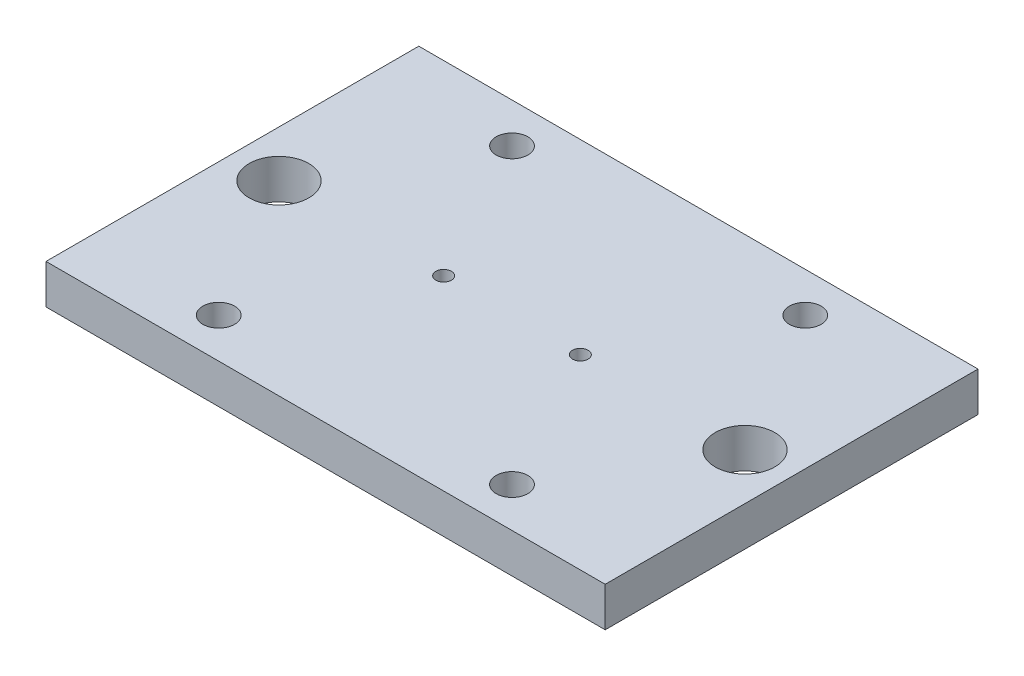
ISO-10303-21;
HEADER;
FILE_DESCRIPTION(('STEP AP214'),'2;1');
FILE_NAME('part.step','',(''),(''),'','','');
FILE_SCHEMA(('AUTOMOTIVE_DESIGN { 1 0 10303 214 1 1 1 1 }'));
ENDSEC;
DATA;
#1=APPLICATION_CONTEXT('core data for automotive mechanical design processes');
#2=APPLICATION_PROTOCOL_DEFINITION('international standard','automotive_design',2000,#1);
#3=PRODUCT_CONTEXT('',#1,'mechanical');
#4=PRODUCT('Part','Part','',(#3));
#5=PRODUCT_RELATED_PRODUCT_CATEGORY('part','',(#4));
#6=PRODUCT_DEFINITION_FORMATION('','',#4);
#7=PRODUCT_DEFINITION_CONTEXT('part definition',#1,'design');
#8=PRODUCT_DEFINITION('design','',#6,#7);
#9=PRODUCT_DEFINITION_SHAPE('','',#8);
#10=(LENGTH_UNIT() NAMED_UNIT(*) SI_UNIT(.MILLI.,.METRE.));
#11=(NAMED_UNIT(*) PLANE_ANGLE_UNIT() SI_UNIT($,.RADIAN.));
#12=(NAMED_UNIT(*) SI_UNIT($,.STERADIAN.) SOLID_ANGLE_UNIT());
#13=UNCERTAINTY_MEASURE_WITH_UNIT(LENGTH_MEASURE(1.E-05),#10,'distance_accuracy_value','');
#14=(GEOMETRIC_REPRESENTATION_CONTEXT(3) GLOBAL_UNCERTAINTY_ASSIGNED_CONTEXT((#13)) GLOBAL_UNIT_ASSIGNED_CONTEXT((#10,
#11,#12)) REPRESENTATION_CONTEXT('',''));
#15=CARTESIAN_POINT('',(0.,0.,0.));
#16=DIRECTION('',(0.,0.,1.));
#17=DIRECTION('',(1.,0.,0.));
#18=AXIS2_PLACEMENT_3D('',#15,#16,#17);
#19=CARTESIAN_POINT('',(0.,6.35,0.));
#20=DIRECTION('',(0.,-1.,0.));
#21=DIRECTION('',(0.,0.,-1.));
#22=AXIS2_PLACEMENT_3D('',#19,#20,#21);
#23=PLANE('',#22);
#24=CARTESIAN_POINT('',(-11.,6.35,0.));
#25=DIRECTION('',(0.,1.,0.));
#26=DIRECTION('',(0.,0.,1.));
#27=AXIS2_PLACEMENT_3D('',#24,#25,#26);
#28=CIRCLE('',#27,1.25);
#29=CARTESIAN_POINT('',(-11.,6.35,1.25));
#30=VERTEX_POINT('',#29);
#31=EDGE_CURVE('E120',#30,#30,#28,.T.);
#32=ORIENTED_EDGE('',*,*,#31,.F.);
#33=EDGE_LOOP('',(#32));
#34=FACE_BOUND('',#33,.T.);
#35=CARTESIAN_POINT('',(11.,6.35,0.));
#36=DIRECTION('',(0.,1.,0.));
#37=DIRECTION('',(0.,0.,1.));
#38=AXIS2_PLACEMENT_3D('',#35,#36,#37);
#39=CIRCLE('',#38,1.25);
#40=CARTESIAN_POINT('',(11.,6.35,1.25));
#41=VERTEX_POINT('',#40);
#42=EDGE_CURVE('E126',#41,#41,#39,.T.);
#43=ORIENTED_EDGE('',*,*,#42,.F.);
#44=EDGE_LOOP('',(#43));
#45=FACE_BOUND('',#44,.T.);
#46=DIRECTION('',(0.,0.,1.));
#47=VECTOR('',#46,1.);
#48=CARTESIAN_POINT('',(-45.,6.35,-30.));
#49=LINE('',#48,#47);
#50=CARTESIAN_POINT('',(-45.,6.35,-30.));
#51=VERTEX_POINT('',#50);
#52=CARTESIAN_POINT('',(-45.,6.35,30.));
#53=VERTEX_POINT('',#52);
#54=EDGE_CURVE('E97',#51,#53,#49,.T.);
#55=ORIENTED_EDGE('',*,*,#54,.T.);
#56=DIRECTION('',(1.,0.,0.));
#57=VECTOR('',#56,1.);
#58=CARTESIAN_POINT('',(45.,6.35,30.));
#59=LINE('',#58,#57);
#60=CARTESIAN_POINT('',(45.,6.35,30.));
#61=VERTEX_POINT('',#60);
#62=EDGE_CURVE('E92',#53,#61,#59,.T.);
#63=ORIENTED_EDGE('',*,*,#62,.T.);
#64=DIRECTION('',(0.,0.,-1.));
#65=VECTOR('',#64,1.);
#66=CARTESIAN_POINT('',(45.,6.35,-30.));
#67=LINE('',#66,#65);
#68=CARTESIAN_POINT('',(45.,6.35,-30.));
#69=VERTEX_POINT('',#68);
#70=EDGE_CURVE('E95',#61,#69,#67,.T.);
#71=ORIENTED_EDGE('',*,*,#70,.T.);
#72=DIRECTION('',(-1.,0.,0.));
#73=VECTOR('',#72,1.);
#74=CARTESIAN_POINT('',(45.,6.35,-30.));
#75=LINE('',#74,#73);
#76=EDGE_CURVE('E62',#69,#51,#75,.T.);
#77=ORIENTED_EDGE('',*,*,#76,.T.);
#78=EDGE_LOOP('',(#55,#63,#71,#77));
#79=FACE_BOUND('',#78,.T.);
#80=CARTESIAN_POINT('',(-37.5,6.35,0.));
#81=DIRECTION('',(0.,1.,0.));
#82=DIRECTION('',(0.,0.,1.));
#83=AXIS2_PLACEMENT_3D('',#80,#81,#82);
#84=CIRCLE('',#83,4.8);
#85=CARTESIAN_POINT('',(-37.5,6.35,4.8));
#86=VERTEX_POINT('',#85);
#87=EDGE_CURVE('E113',#86,#86,#84,.T.);
#88=ORIENTED_EDGE('',*,*,#87,.F.);
#89=EDGE_LOOP('',(#88));
#90=FACE_BOUND('',#89,.T.);
#91=CARTESIAN_POINT('',(37.5,6.35,0.));
#92=DIRECTION('',(0.,1.,0.));
#93=DIRECTION('',(0.,0.,1.));
#94=AXIS2_PLACEMENT_3D('',#91,#92,#93);
#95=CIRCLE('',#94,4.8);
#96=CARTESIAN_POINT('',(37.5,6.35,4.8));
#97=VERTEX_POINT('',#96);
#98=EDGE_CURVE('E157',#97,#97,#95,.T.);
#99=ORIENTED_EDGE('',*,*,#98,.F.);
#100=EDGE_LOOP('',(#99));
#101=FACE_BOUND('',#100,.T.);
#102=CARTESIAN_POINT('',(-23.6,6.35,23.6));
#103=DIRECTION('',(0.,1.,0.));
#104=DIRECTION('',(0.,0.,1.));
#105=AXIS2_PLACEMENT_3D('',#102,#103,#104);
#106=CIRCLE('',#105,2.55);
#107=CARTESIAN_POINT('',(-23.6,6.35,26.15));
#108=VERTEX_POINT('',#107);
#109=EDGE_CURVE('E151',#108,#108,#106,.T.);
#110=ORIENTED_EDGE('',*,*,#109,.F.);
#111=EDGE_LOOP('',(#110));
#112=FACE_BOUND('',#111,.T.);
#113=CARTESIAN_POINT('',(23.6,6.35,23.6));
#114=DIRECTION('',(0.,1.,0.));
#115=DIRECTION('',(0.,0.,1.));
#116=AXIS2_PLACEMENT_3D('',#113,#114,#115);
#117=CIRCLE('',#116,2.55);
#118=CARTESIAN_POINT('',(23.6,6.35,26.15));
#119=VERTEX_POINT('',#118);
#120=EDGE_CURVE('E145',#119,#119,#117,.T.);
#121=ORIENTED_EDGE('',*,*,#120,.F.);
#122=EDGE_LOOP('',(#121));
#123=FACE_BOUND('',#122,.T.);
#124=CARTESIAN_POINT('',(23.6,6.35,-23.6));
#125=DIRECTION('',(0.,1.,0.));
#126=DIRECTION('',(0.,0.,1.));
#127=AXIS2_PLACEMENT_3D('',#124,#125,#126);
#128=CIRCLE('',#127,2.55);
#129=CARTESIAN_POINT('',(23.6,6.35,-21.05));
#130=VERTEX_POINT('',#129);
#131=EDGE_CURVE('E139',#130,#130,#128,.T.);
#132=ORIENTED_EDGE('',*,*,#131,.F.);
#133=EDGE_LOOP('',(#132));
#134=FACE_BOUND('',#133,.T.);
#135=CARTESIAN_POINT('',(-23.6,6.35,-23.6));
#136=DIRECTION('',(0.,1.,0.));
#137=DIRECTION('',(0.,0.,1.));
#138=AXIS2_PLACEMENT_3D('',#135,#136,#137);
#139=CIRCLE('',#138,2.55);
#140=CARTESIAN_POINT('',(-23.6,6.35,-21.05));
#141=VERTEX_POINT('',#140);
#142=EDGE_CURVE('E133',#141,#141,#139,.T.);
#143=ORIENTED_EDGE('',*,*,#142,.F.);
#144=EDGE_LOOP('',(#143));
#145=FACE_BOUND('',#144,.T.);
#146=ADVANCED_FACE('F43',(#34,#45,#79,#90,#101,#112,#123,#134,#145),#23,.F.);
#147=CARTESIAN_POINT('',(0.,0.,0.));
#148=DIRECTION('',(0.,-1.,0.));
#149=DIRECTION('',(0.,0.,-1.));
#150=AXIS2_PLACEMENT_3D('',#147,#148,#149);
#151=PLANE('',#150);
#152=CARTESIAN_POINT('',(-11.,0.,0.));
#153=DIRECTION('',(0.,-1.,0.));
#154=DIRECTION('',(0.,0.,-1.));
#155=AXIS2_PLACEMENT_3D('',#152,#153,#154);
#156=CIRCLE('',#155,1.25);
#157=CARTESIAN_POINT('',(-11.,0.,-1.25));
#158=VERTEX_POINT('',#157);
#159=EDGE_CURVE('E47',#158,#158,#156,.T.);
#160=ORIENTED_EDGE('',*,*,#159,.F.);
#161=EDGE_LOOP('',(#160));
#162=FACE_BOUND('',#161,.T.);
#163=CARTESIAN_POINT('',(11.,0.,0.));
#164=DIRECTION('',(0.,-1.,0.));
#165=DIRECTION('',(0.,0.,-1.));
#166=AXIS2_PLACEMENT_3D('',#163,#164,#165);
#167=CIRCLE('',#166,1.25);
#168=CARTESIAN_POINT('',(11.,0.,-1.25));
#169=VERTEX_POINT('',#168);
#170=EDGE_CURVE('E118',#169,#169,#167,.T.);
#171=ORIENTED_EDGE('',*,*,#170,.F.);
#172=EDGE_LOOP('',(#171));
#173=FACE_BOUND('',#172,.T.);
#174=CARTESIAN_POINT('',(23.6,0.,-23.6));
#175=DIRECTION('',(0.,1.,0.));
#176=DIRECTION('',(0.,0.,1.));
#177=AXIS2_PLACEMENT_3D('',#174,#175,#176);
#178=CIRCLE('',#177,2.55);
#179=CARTESIAN_POINT('',(23.6,0.,-21.05));
#180=VERTEX_POINT('',#179);
#181=EDGE_CURVE('E136',#180,#180,#178,.T.);
#182=ORIENTED_EDGE('',*,*,#181,.T.);
#183=EDGE_LOOP('',(#182));
#184=FACE_BOUND('',#183,.T.);
#185=CARTESIAN_POINT('',(-23.6,0.,23.6));
#186=DIRECTION('',(0.,1.,0.));
#187=DIRECTION('',(0.,0.,1.));
#188=AXIS2_PLACEMENT_3D('',#185,#186,#187);
#189=CIRCLE('',#188,2.55);
#190=CARTESIAN_POINT('',(-23.6,0.,26.15));
#191=VERTEX_POINT('',#190);
#192=EDGE_CURVE('E148',#191,#191,#189,.T.);
#193=ORIENTED_EDGE('',*,*,#192,.T.);
#194=EDGE_LOOP('',(#193));
#195=FACE_BOUND('',#194,.T.);
#196=CARTESIAN_POINT('',(-37.5,0.,0.));
#197=DIRECTION('',(0.,1.,0.));
#198=DIRECTION('',(0.,0.,1.));
#199=AXIS2_PLACEMENT_3D('',#196,#197,#198);
#200=CIRCLE('',#199,4.8);
#201=CARTESIAN_POINT('',(-37.5,0.,4.8));
#202=VERTEX_POINT('',#201);
#203=EDGE_CURVE('E160',#202,#202,#200,.T.);
#204=ORIENTED_EDGE('',*,*,#203,.T.);
#205=EDGE_LOOP('',(#204));
#206=FACE_BOUND('',#205,.T.);
#207=DIRECTION('',(0.,0.,1.));
#208=VECTOR('',#207,1.);
#209=CARTESIAN_POINT('',(-45.,0.,-30.));
#210=LINE('',#209,#208);
#211=CARTESIAN_POINT('',(-45.,0.,-30.));
#212=VERTEX_POINT('',#211);
#213=CARTESIAN_POINT('',(-45.,0.,30.));
#214=VERTEX_POINT('',#213);
#215=EDGE_CURVE('E110',#212,#214,#210,.T.);
#216=ORIENTED_EDGE('',*,*,#215,.F.);
#217=DIRECTION('',(-1.,0.,0.));
#218=VECTOR('',#217,1.);
#219=CARTESIAN_POINT('',(45.,0.,-30.));
#220=LINE('',#219,#218);
#221=CARTESIAN_POINT('',(45.,0.,-30.));
#222=VERTEX_POINT('',#221);
#223=EDGE_CURVE('E85',#222,#212,#220,.T.);
#224=ORIENTED_EDGE('',*,*,#223,.F.);
#225=DIRECTION('',(0.,0.,-1.));
#226=VECTOR('',#225,1.);
#227=CARTESIAN_POINT('',(45.,0.,-30.));
#228=LINE('',#227,#226);
#229=CARTESIAN_POINT('',(45.,0.,30.));
#230=VERTEX_POINT('',#229);
#231=EDGE_CURVE('E79',#230,#222,#228,.T.);
#232=ORIENTED_EDGE('',*,*,#231,.F.);
#233=DIRECTION('',(1.,0.,0.));
#234=VECTOR('',#233,1.);
#235=CARTESIAN_POINT('',(45.,0.,30.));
#236=LINE('',#235,#234);
#237=EDGE_CURVE('E101',#214,#230,#236,.T.);
#238=ORIENTED_EDGE('',*,*,#237,.F.);
#239=EDGE_LOOP('',(#216,#224,#232,#238));
#240=FACE_BOUND('',#239,.T.);
#241=CARTESIAN_POINT('',(37.5,0.,0.));
#242=DIRECTION('',(0.,1.,0.));
#243=DIRECTION('',(0.,0.,1.));
#244=AXIS2_PLACEMENT_3D('',#241,#242,#243);
#245=CIRCLE('',#244,4.8);
#246=CARTESIAN_POINT('',(37.5,0.,4.8));
#247=VERTEX_POINT('',#246);
#248=EDGE_CURVE('E154',#247,#247,#245,.T.);
#249=ORIENTED_EDGE('',*,*,#248,.T.);
#250=EDGE_LOOP('',(#249));
#251=FACE_BOUND('',#250,.T.);
#252=CARTESIAN_POINT('',(23.6,0.,23.6));
#253=DIRECTION('',(0.,1.,0.));
#254=DIRECTION('',(0.,0.,1.));
#255=AXIS2_PLACEMENT_3D('',#252,#253,#254);
#256=CIRCLE('',#255,2.55);
#257=CARTESIAN_POINT('',(23.6,0.,26.15));
#258=VERTEX_POINT('',#257);
#259=EDGE_CURVE('E142',#258,#258,#256,.T.);
#260=ORIENTED_EDGE('',*,*,#259,.T.);
#261=EDGE_LOOP('',(#260));
#262=FACE_BOUND('',#261,.T.);
#263=CARTESIAN_POINT('',(-23.6,0.,-23.6));
#264=DIRECTION('',(0.,1.,0.));
#265=DIRECTION('',(0.,0.,1.));
#266=AXIS2_PLACEMENT_3D('',#263,#264,#265);
#267=CIRCLE('',#266,2.55);
#268=CARTESIAN_POINT('',(-23.6,0.,-21.05));
#269=VERTEX_POINT('',#268);
#270=EDGE_CURVE('E124',#269,#269,#267,.T.);
#271=ORIENTED_EDGE('',*,*,#270,.T.);
#272=EDGE_LOOP('',(#271));
#273=FACE_BOUND('',#272,.T.);
#274=ADVANCED_FACE('F168',(#162,#173,#184,#195,#206,#240,#251,#262,#273),#151,.T.);
#275=CARTESIAN_POINT('',(-45.,6.35,-30.));
#276=DIRECTION('',(1.,0.,0.));
#277=DIRECTION('',(0.,0.,-1.));
#278=AXIS2_PLACEMENT_3D('',#275,#276,#277);
#279=PLANE('',#278);
#280=ORIENTED_EDGE('',*,*,#215,.T.);
#281=DIRECTION('',(0.,-1.,0.));
#282=VECTOR('',#281,1.);
#283=CARTESIAN_POINT('',(-45.,6.35,30.));
#284=LINE('',#283,#282);
#285=EDGE_CURVE('E11',#53,#214,#284,.T.);
#286=ORIENTED_EDGE('',*,*,#285,.F.);
#287=ORIENTED_EDGE('',*,*,#54,.F.);
#288=DIRECTION('',(0.,-1.,0.));
#289=VECTOR('',#288,1.);
#290=CARTESIAN_POINT('',(-45.,6.35,-30.));
#291=LINE('',#290,#289);
#292=EDGE_CURVE('E106',#51,#212,#291,.T.);
#293=ORIENTED_EDGE('',*,*,#292,.T.);
#294=EDGE_LOOP('',(#280,#286,#287,#293));
#295=FACE_BOUND('',#294,.T.);
#296=ADVANCED_FACE('F45',(#295),#279,.F.);
#297=CARTESIAN_POINT('',(45.,6.35,30.));
#298=DIRECTION('',(0.,0.,-1.));
#299=DIRECTION('',(-1.,0.,0.));
#300=AXIS2_PLACEMENT_3D('',#297,#298,#299);
#301=PLANE('',#300);
#302=ORIENTED_EDGE('',*,*,#237,.T.);
#303=DIRECTION('',(0.,-1.,0.));
#304=VECTOR('',#303,1.);
#305=CARTESIAN_POINT('',(45.,6.35,30.));
#306=LINE('',#305,#304);
#307=EDGE_CURVE('E53',#61,#230,#306,.T.);
#308=ORIENTED_EDGE('',*,*,#307,.F.);
#309=ORIENTED_EDGE('',*,*,#62,.F.);
#310=ORIENTED_EDGE('',*,*,#285,.T.);
#311=EDGE_LOOP('',(#302,#308,#309,#310));
#312=FACE_BOUND('',#311,.T.);
#313=ADVANCED_FACE('F100',(#312),#301,.F.);
#314=CARTESIAN_POINT('',(45.,6.35,-30.));
#315=DIRECTION('',(-1.,0.,0.));
#316=DIRECTION('',(0.,0.,1.));
#317=AXIS2_PLACEMENT_3D('',#314,#315,#316);
#318=PLANE('',#317);
#319=ORIENTED_EDGE('',*,*,#231,.T.);
#320=DIRECTION('',(0.,-1.,0.));
#321=VECTOR('',#320,1.);
#322=CARTESIAN_POINT('',(45.,6.35,-30.));
#323=LINE('',#322,#321);
#324=EDGE_CURVE('E102',#69,#222,#323,.T.);
#325=ORIENTED_EDGE('',*,*,#324,.F.);
#326=ORIENTED_EDGE('',*,*,#70,.F.);
#327=ORIENTED_EDGE('',*,*,#307,.T.);
#328=EDGE_LOOP('',(#319,#325,#326,#327));
#329=FACE_BOUND('',#328,.T.);
#330=ADVANCED_FACE('F104',(#329),#318,.F.);
#331=CARTESIAN_POINT('',(45.,6.35,-30.));
#332=DIRECTION('',(0.,0.,1.));
#333=DIRECTION('',(1.,0.,0.));
#334=AXIS2_PLACEMENT_3D('',#331,#332,#333);
#335=PLANE('',#334);
#336=ORIENTED_EDGE('',*,*,#223,.T.);
#337=ORIENTED_EDGE('',*,*,#292,.F.);
#338=ORIENTED_EDGE('',*,*,#76,.F.);
#339=ORIENTED_EDGE('',*,*,#324,.T.);
#340=EDGE_LOOP('',(#336,#337,#338,#339));
#341=FACE_BOUND('',#340,.T.);
#342=ADVANCED_FACE('F174',(#341),#335,.F.);
#343=CARTESIAN_POINT('',(-37.5,6.35,0.));
#344=DIRECTION('',(0.,-1.,0.));
#345=DIRECTION('',(0.,0.,-1.));
#346=AXIS2_PLACEMENT_3D('',#343,#344,#345);
#347=CYLINDRICAL_SURFACE('',#346,4.8);
#348=ORIENTED_EDGE('',*,*,#87,.T.);
#349=EDGE_LOOP('',(#348));
#350=FACE_BOUND('',#349,.T.);
#351=ORIENTED_EDGE('',*,*,#203,.F.);
#352=EDGE_LOOP('',(#351));
#353=FACE_BOUND('',#352,.T.);
#354=ADVANCED_FACE('F171',(#350,#353),#347,.F.);
#355=CARTESIAN_POINT('',(37.5,6.35,0.));
#356=DIRECTION('',(0.,-1.,0.));
#357=DIRECTION('',(0.,0.,-1.));
#358=AXIS2_PLACEMENT_3D('',#355,#356,#357);
#359=CYLINDRICAL_SURFACE('',#358,4.8);
#360=ORIENTED_EDGE('',*,*,#98,.T.);
#361=EDGE_LOOP('',(#360));
#362=FACE_BOUND('',#361,.T.);
#363=ORIENTED_EDGE('',*,*,#248,.F.);
#364=EDGE_LOOP('',(#363));
#365=FACE_BOUND('',#364,.T.);
#366=ADVANCED_FACE('F173',(#362,#365),#359,.F.);
#367=CARTESIAN_POINT('',(-23.6,6.35,23.6));
#368=DIRECTION('',(0.,-1.,0.));
#369=DIRECTION('',(0.,0.,-1.));
#370=AXIS2_PLACEMENT_3D('',#367,#368,#369);
#371=CYLINDRICAL_SURFACE('',#370,2.55);
#372=ORIENTED_EDGE('',*,*,#109,.T.);
#373=EDGE_LOOP('',(#372));
#374=FACE_BOUND('',#373,.T.);
#375=ORIENTED_EDGE('',*,*,#192,.F.);
#376=EDGE_LOOP('',(#375));
#377=FACE_BOUND('',#376,.T.);
#378=ADVANCED_FACE('F181',(#374,#377),#371,.F.);
#379=CARTESIAN_POINT('',(23.6,6.35,23.6));
#380=DIRECTION('',(0.,-1.,0.));
#381=DIRECTION('',(0.,0.,-1.));
#382=AXIS2_PLACEMENT_3D('',#379,#380,#381);
#383=CYLINDRICAL_SURFACE('',#382,2.55);
#384=ORIENTED_EDGE('',*,*,#120,.T.);
#385=EDGE_LOOP('',(#384));
#386=FACE_BOUND('',#385,.T.);
#387=ORIENTED_EDGE('',*,*,#259,.F.);
#388=EDGE_LOOP('',(#387));
#389=FACE_BOUND('',#388,.T.);
#390=ADVANCED_FACE('F223',(#386,#389),#383,.F.);
#391=CARTESIAN_POINT('',(23.6,6.35,-23.6));
#392=DIRECTION('',(0.,-1.,0.));
#393=DIRECTION('',(0.,0.,-1.));
#394=AXIS2_PLACEMENT_3D('',#391,#392,#393);
#395=CYLINDRICAL_SURFACE('',#394,2.55);
#396=ORIENTED_EDGE('',*,*,#131,.T.);
#397=EDGE_LOOP('',(#396));
#398=FACE_BOUND('',#397,.T.);
#399=ORIENTED_EDGE('',*,*,#181,.F.);
#400=EDGE_LOOP('',(#399));
#401=FACE_BOUND('',#400,.T.);
#402=ADVANCED_FACE('F214',(#398,#401),#395,.F.);
#403=CARTESIAN_POINT('',(-23.6,6.35,-23.6));
#404=DIRECTION('',(0.,-1.,0.));
#405=DIRECTION('',(0.,0.,-1.));
#406=AXIS2_PLACEMENT_3D('',#403,#404,#405);
#407=CYLINDRICAL_SURFACE('',#406,2.55);
#408=ORIENTED_EDGE('',*,*,#142,.T.);
#409=EDGE_LOOP('',(#408));
#410=FACE_BOUND('',#409,.T.);
#411=ORIENTED_EDGE('',*,*,#270,.F.);
#412=EDGE_LOOP('',(#411));
#413=FACE_BOUND('',#412,.T.);
#414=ADVANCED_FACE('F212',(#410,#413),#407,.F.);
#415=CARTESIAN_POINT('',(11.,-1.65,0.));
#416=DIRECTION('',(0.,1.,0.));
#417=DIRECTION('',(0.,0.,1.));
#418=AXIS2_PLACEMENT_3D('',#415,#416,#417);
#419=CYLINDRICAL_SURFACE('',#418,1.25);
#420=ORIENTED_EDGE('',*,*,#170,.T.);
#421=EDGE_LOOP('',(#420));
#422=FACE_BOUND('',#421,.T.);
#423=ORIENTED_EDGE('',*,*,#42,.T.);
#424=EDGE_LOOP('',(#423));
#425=FACE_BOUND('',#424,.T.);
#426=ADVANCED_FACE('F213',(#422,#425),#419,.F.);
#427=CARTESIAN_POINT('',(-11.,-1.65,0.));
#428=DIRECTION('',(0.,1.,0.));
#429=DIRECTION('',(0.,0.,1.));
#430=AXIS2_PLACEMENT_3D('',#427,#428,#429);
#431=CYLINDRICAL_SURFACE('',#430,1.25);
#432=ORIENTED_EDGE('',*,*,#159,.T.);
#433=EDGE_LOOP('',(#432));
#434=FACE_BOUND('',#433,.T.);
#435=ORIENTED_EDGE('',*,*,#31,.T.);
#436=EDGE_LOOP('',(#435));
#437=FACE_BOUND('',#436,.T.);
#438=ADVANCED_FACE('F221',(#434,#437),#431,.F.);
#439=CLOSED_SHELL('',(#146,#274,#296,#313,#330,#342,#354,#366,#378,#390,#402,#414,#426,#438));
#440=MANIFOLD_SOLID_BREP('B2',#439);
#441=ADVANCED_BREP_SHAPE_REPRESENTATION('',(#18,#440),#14);
#442=SHAPE_DEFINITION_REPRESENTATION(#9,#441);
ENDSEC;
END-ISO-10303-21;
